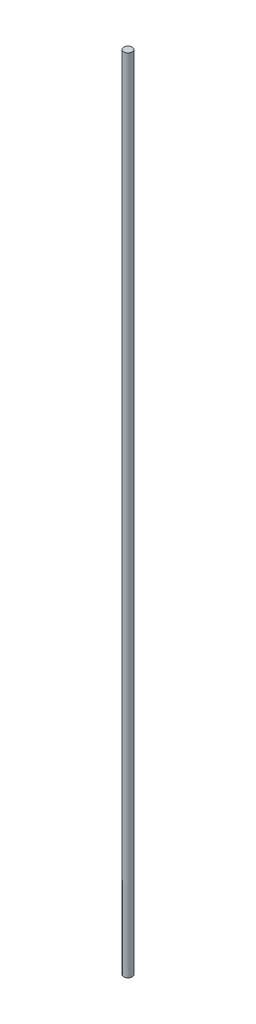
ISO-10303-21;
HEADER;
FILE_DESCRIPTION(('STEP AP214'),'2;1');
FILE_NAME('part.step','',(''),(''),'','','');
FILE_SCHEMA(('AUTOMOTIVE_DESIGN { 1 0 10303 214 1 1 1 1 }'));
ENDSEC;
DATA;
#1=APPLICATION_CONTEXT('core data for automotive mechanical design processes');
#2=APPLICATION_PROTOCOL_DEFINITION('international standard','automotive_design',2000,#1);
#3=PRODUCT_CONTEXT('',#1,'mechanical');
#4=PRODUCT('Part','Part','',(#3));
#5=PRODUCT_RELATED_PRODUCT_CATEGORY('part','',(#4));
#6=PRODUCT_DEFINITION_FORMATION('','',#4);
#7=PRODUCT_DEFINITION_CONTEXT('part definition',#1,'design');
#8=PRODUCT_DEFINITION('design','',#6,#7);
#9=PRODUCT_DEFINITION_SHAPE('','',#8);
#10=(LENGTH_UNIT() NAMED_UNIT(*) SI_UNIT(.MILLI.,.METRE.));
#11=(NAMED_UNIT(*) PLANE_ANGLE_UNIT() SI_UNIT($,.RADIAN.));
#12=(NAMED_UNIT(*) SI_UNIT($,.STERADIAN.) SOLID_ANGLE_UNIT());
#13=UNCERTAINTY_MEASURE_WITH_UNIT(LENGTH_MEASURE(1.E-05),#10,'distance_accuracy_value','');
#14=(GEOMETRIC_REPRESENTATION_CONTEXT(3) GLOBAL_UNCERTAINTY_ASSIGNED_CONTEXT((#13)) GLOBAL_UNIT_ASSIGNED_CONTEXT((#10,
#11,#12)) REPRESENTATION_CONTEXT('',''));
#15=CARTESIAN_POINT('',(0.,0.,0.));
#16=DIRECTION('',(0.,0.,1.));
#17=DIRECTION('',(1.,0.,0.));
#18=AXIS2_PLACEMENT_3D('',#15,#16,#17);
#19=CARTESIAN_POINT('',(0.,284.,0.));
#20=DIRECTION('',(0.,-1.,0.));
#21=DIRECTION('',(0.,0.,-1.));
#22=AXIS2_PLACEMENT_3D('',#19,#20,#21);
#23=CYLINDRICAL_SURFACE('',#22,1.5);
#24=CARTESIAN_POINT('',(0.,284.,0.));
#25=DIRECTION('',(0.,1.,0.));
#26=DIRECTION('',(0.,0.,1.));
#27=AXIS2_PLACEMENT_3D('',#24,#25,#26);
#28=CIRCLE('',#27,1.5);
#29=CARTESIAN_POINT('',(0.,284.,1.5));
#30=VERTEX_POINT('',#29);
#31=EDGE_CURVE('E10',#30,#30,#28,.T.);
#32=ORIENTED_EDGE('',*,*,#31,.F.);
#33=EDGE_LOOP('',(#32));
#34=FACE_BOUND('',#33,.T.);
#35=CARTESIAN_POINT('',(0.,0.,0.));
#36=DIRECTION('',(0.,1.,0.));
#37=DIRECTION('',(0.,0.,1.));
#38=AXIS2_PLACEMENT_3D('',#35,#36,#37);
#39=CIRCLE('',#38,1.5);
#40=CARTESIAN_POINT('',(0.,0.,1.5));
#41=VERTEX_POINT('',#40);
#42=EDGE_CURVE('E30',#41,#41,#39,.T.);
#43=ORIENTED_EDGE('',*,*,#42,.T.);
#44=EDGE_LOOP('',(#43));
#45=FACE_BOUND('',#44,.T.);
#46=ADVANCED_FACE('F24',(#34,#45),#23,.T.);
#47=CARTESIAN_POINT('',(0.,284.,0.));
#48=DIRECTION('',(0.,1.,0.));
#49=DIRECTION('',(0.,0.,1.));
#50=AXIS2_PLACEMENT_3D('',#47,#48,#49);
#51=PLANE('',#50);
#52=ORIENTED_EDGE('',*,*,#31,.T.);
#53=EDGE_LOOP('',(#52));
#54=FACE_BOUND('',#53,.T.);
#55=ADVANCED_FACE('F39',(#54),#51,.T.);
#56=CARTESIAN_POINT('',(0.,0.,0.));
#57=DIRECTION('',(0.,1.,0.));
#58=DIRECTION('',(0.,0.,1.));
#59=AXIS2_PLACEMENT_3D('',#56,#57,#58);
#60=PLANE('',#59);
#61=ORIENTED_EDGE('',*,*,#42,.F.);
#62=EDGE_LOOP('',(#61));
#63=FACE_BOUND('',#62,.T.);
#64=ADVANCED_FACE('F37',(#63),#60,.F.);
#65=CLOSED_SHELL('',(#46,#55,#64));
#66=MANIFOLD_SOLID_BREP('B2',#65);
#67=ADVANCED_BREP_SHAPE_REPRESENTATION('',(#18,#66),#14);
#68=SHAPE_DEFINITION_REPRESENTATION(#9,#67);
ENDSEC;
END-ISO-10303-21;
